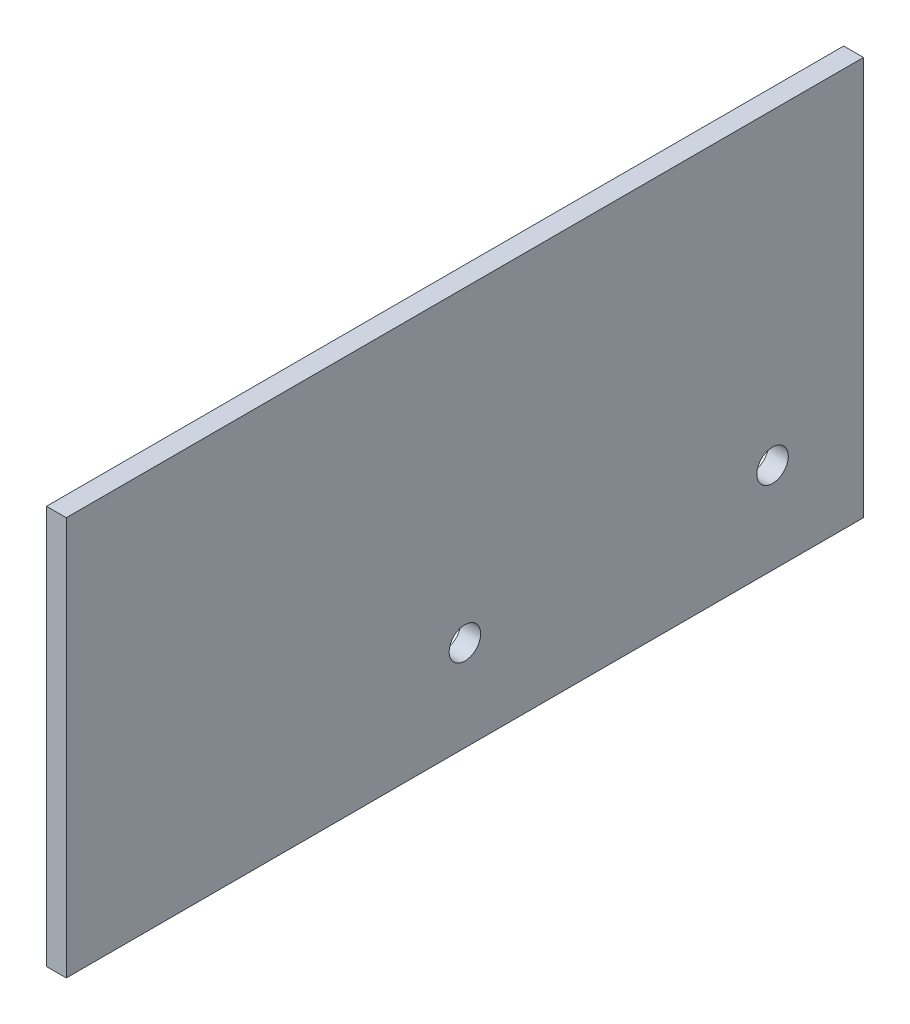
ISO-10303-21;
HEADER;
FILE_DESCRIPTION(('STEP AP214'),'2;1');
FILE_NAME('part.step','',(''),(''),'','','');
FILE_SCHEMA(('AUTOMOTIVE_DESIGN { 1 0 10303 214 1 1 1 1 }'));
ENDSEC;
DATA;
#1=APPLICATION_CONTEXT('core data for automotive mechanical design processes');
#2=APPLICATION_PROTOCOL_DEFINITION('international standard','automotive_design',2000,#1);
#3=PRODUCT_CONTEXT('',#1,'mechanical');
#4=PRODUCT('Part','Part','',(#3));
#5=PRODUCT_RELATED_PRODUCT_CATEGORY('part','',(#4));
#6=PRODUCT_DEFINITION_FORMATION('','',#4);
#7=PRODUCT_DEFINITION_CONTEXT('part definition',#1,'design');
#8=PRODUCT_DEFINITION('design','',#6,#7);
#9=PRODUCT_DEFINITION_SHAPE('','',#8);
#10=(LENGTH_UNIT() NAMED_UNIT(*) SI_UNIT(.MILLI.,.METRE.));
#11=(NAMED_UNIT(*) PLANE_ANGLE_UNIT() SI_UNIT($,.RADIAN.));
#12=(NAMED_UNIT(*) SI_UNIT($,.STERADIAN.) SOLID_ANGLE_UNIT());
#13=UNCERTAINTY_MEASURE_WITH_UNIT(LENGTH_MEASURE(1.E-05),#10,'distance_accuracy_value','');
#14=(GEOMETRIC_REPRESENTATION_CONTEXT(3) GLOBAL_UNCERTAINTY_ASSIGNED_CONTEXT((#13)) GLOBAL_UNIT_ASSIGNED_CONTEXT((#10,
#11,#12)) REPRESENTATION_CONTEXT('',''));
#15=CARTESIAN_POINT('',(0.,0.,0.));
#16=DIRECTION('',(0.,0.,1.));
#17=DIRECTION('',(1.,0.,0.));
#18=AXIS2_PLACEMENT_3D('',#15,#16,#17);
#19=CARTESIAN_POINT('',(2.25,0.,0.));
#20=DIRECTION('',(1.,0.,0.));
#21=DIRECTION('',(0.,0.,-1.));
#22=AXIS2_PLACEMENT_3D('',#19,#20,#21);
#23=PLANE('',#22);
#24=CARTESIAN_POINT('',(2.25,-69.85,0.));
#25=DIRECTION('',(1.,0.,0.));
#26=DIRECTION('',(0.,0.,-1.));
#27=AXIS2_PLACEMENT_3D('',#24,#25,#26);
#28=CIRCLE('',#27,3.56870000000001);
#29=CARTESIAN_POINT('',(2.25,-69.85,-3.56870000000001));
#30=VERTEX_POINT('',#29);
#31=EDGE_CURVE('E108',#30,#30,#28,.T.);
#32=ORIENTED_EDGE('',*,*,#31,.F.);
#33=EDGE_LOOP('',(#32));
#34=FACE_BOUND('',#33,.T.);
#35=DIRECTION('',(0.,0.,1.));
#36=VECTOR('',#35,1.);
#37=CARTESIAN_POINT('',(2.25,0.,-90.5));
#38=LINE('',#37,#36);
#39=CARTESIAN_POINT('',(2.25,0.,-90.5));
#40=VERTEX_POINT('',#39);
#41=CARTESIAN_POINT('',(2.25,0.,90.5));
#42=VERTEX_POINT('',#41);
#43=EDGE_CURVE('E86',#40,#42,#38,.T.);
#44=ORIENTED_EDGE('',*,*,#43,.T.);
#45=DIRECTION('',(0.,-1.,0.));
#46=VECTOR('',#45,1.);
#47=CARTESIAN_POINT('',(2.25,0.,90.5));
#48=LINE('',#47,#46);
#49=CARTESIAN_POINT('',(2.25,-90.5,90.5));
#50=VERTEX_POINT('',#49);
#51=EDGE_CURVE('E81',#42,#50,#48,.T.);
#52=ORIENTED_EDGE('',*,*,#51,.T.);
#53=DIRECTION('',(0.,0.,-1.));
#54=VECTOR('',#53,1.);
#55=CARTESIAN_POINT('',(2.25,-90.5,90.5));
#56=LINE('',#55,#54);
#57=CARTESIAN_POINT('',(2.25,-90.5,-90.5));
#58=VERTEX_POINT('',#57);
#59=EDGE_CURVE('E84',#50,#58,#56,.T.);
#60=ORIENTED_EDGE('',*,*,#59,.T.);
#61=DIRECTION('',(0.,1.,0.));
#62=VECTOR('',#61,1.);
#63=CARTESIAN_POINT('',(2.25,-90.5,-90.5));
#64=LINE('',#63,#62);
#65=EDGE_CURVE('E51',#58,#40,#64,.T.);
#66=ORIENTED_EDGE('',*,*,#65,.T.);
#67=EDGE_LOOP('',(#44,#52,#60,#66));
#68=FACE_BOUND('',#67,.T.);
#69=CARTESIAN_POINT('',(2.25,-69.85,-69.85));
#70=DIRECTION('',(1.,0.,0.));
#71=DIRECTION('',(0.,0.,-1.));
#72=AXIS2_PLACEMENT_3D('',#69,#70,#71);
#73=CIRCLE('',#72,3.56870000000001);
#74=CARTESIAN_POINT('',(2.25,-69.85,-73.4187));
#75=VERTEX_POINT('',#74);
#76=EDGE_CURVE('E116',#75,#75,#73,.T.);
#77=ORIENTED_EDGE('',*,*,#76,.F.);
#78=EDGE_LOOP('',(#77));
#79=FACE_BOUND('',#78,.T.);
#80=ADVANCED_FACE('F32',(#34,#68,#79),#23,.T.);
#81=CARTESIAN_POINT('',(-2.25,0.,0.));
#82=DIRECTION('',(1.,0.,0.));
#83=DIRECTION('',(0.,0.,-1.));
#84=AXIS2_PLACEMENT_3D('',#81,#82,#83);
#85=PLANE('',#84);
#86=CARTESIAN_POINT('',(-2.25,-69.85,0.));
#87=DIRECTION('',(1.,0.,0.));
#88=DIRECTION('',(0.,0.,-1.));
#89=AXIS2_PLACEMENT_3D('',#86,#87,#88);
#90=CIRCLE('',#89,3.56870000000001);
#91=CARTESIAN_POINT('',(-2.25,-69.85,-3.56870000000001));
#92=VERTEX_POINT('',#91);
#93=EDGE_CURVE('E102',#92,#92,#90,.F.);
#94=ORIENTED_EDGE('',*,*,#93,.F.);
#95=EDGE_LOOP('',(#94));
#96=FACE_BOUND('',#95,.T.);
#97=DIRECTION('',(0.,0.,1.));
#98=VECTOR('',#97,1.);
#99=CARTESIAN_POINT('',(-2.25,0.,-90.5));
#100=LINE('',#99,#98);
#101=CARTESIAN_POINT('',(-2.25,0.,-90.5));
#102=VERTEX_POINT('',#101);
#103=CARTESIAN_POINT('',(-2.25,0.,90.5));
#104=VERTEX_POINT('',#103);
#105=EDGE_CURVE('E99',#102,#104,#100,.T.);
#106=ORIENTED_EDGE('',*,*,#105,.F.);
#107=DIRECTION('',(0.,1.,0.));
#108=VECTOR('',#107,1.);
#109=CARTESIAN_POINT('',(-2.25,-90.5,-90.5));
#110=LINE('',#109,#108);
#111=CARTESIAN_POINT('',(-2.25,-90.5,-90.5));
#112=VERTEX_POINT('',#111);
#113=EDGE_CURVE('E74',#112,#102,#110,.T.);
#114=ORIENTED_EDGE('',*,*,#113,.F.);
#115=DIRECTION('',(0.,0.,-1.));
#116=VECTOR('',#115,1.);
#117=CARTESIAN_POINT('',(-2.25,-90.5,90.5));
#118=LINE('',#117,#116);
#119=CARTESIAN_POINT('',(-2.25,-90.5,90.5));
#120=VERTEX_POINT('',#119);
#121=EDGE_CURVE('E68',#120,#112,#118,.T.);
#122=ORIENTED_EDGE('',*,*,#121,.F.);
#123=DIRECTION('',(0.,-1.,0.));
#124=VECTOR('',#123,1.);
#125=CARTESIAN_POINT('',(-2.25,0.,90.5));
#126=LINE('',#125,#124);
#127=EDGE_CURVE('E90',#104,#120,#126,.T.);
#128=ORIENTED_EDGE('',*,*,#127,.F.);
#129=EDGE_LOOP('',(#106,#114,#122,#128));
#130=FACE_BOUND('',#129,.T.);
#131=CARTESIAN_POINT('',(-2.25,-69.85,-69.85));
#132=DIRECTION('',(1.,0.,0.));
#133=DIRECTION('',(0.,0.,-1.));
#134=AXIS2_PLACEMENT_3D('',#131,#132,#133);
#135=CIRCLE('',#134,3.56870000000001);
#136=CARTESIAN_POINT('',(-2.25,-69.85,-73.4187));
#137=VERTEX_POINT('',#136);
#138=EDGE_CURVE('E36',#137,#137,#135,.F.);
#139=ORIENTED_EDGE('',*,*,#138,.F.);
#140=EDGE_LOOP('',(#139));
#141=FACE_BOUND('',#140,.T.);
#142=ADVANCED_FACE('F124',(#96,#130,#141),#85,.F.);
#143=CARTESIAN_POINT('',(2.25,0.,-90.5));
#144=DIRECTION('',(0.,-1.,0.));
#145=DIRECTION('',(0.,0.,-1.));
#146=AXIS2_PLACEMENT_3D('',#143,#144,#145);
#147=PLANE('',#146);
#148=ORIENTED_EDGE('',*,*,#105,.T.);
#149=DIRECTION('',(-1.,0.,0.));
#150=VECTOR('',#149,1.);
#151=CARTESIAN_POINT('',(2.25,0.,90.5));
#152=LINE('',#151,#150);
#153=EDGE_CURVE('E11',#42,#104,#152,.T.);
#154=ORIENTED_EDGE('',*,*,#153,.F.);
#155=ORIENTED_EDGE('',*,*,#43,.F.);
#156=DIRECTION('',(-1.,0.,0.));
#157=VECTOR('',#156,1.);
#158=CARTESIAN_POINT('',(2.25,0.,-90.5));
#159=LINE('',#158,#157);
#160=EDGE_CURVE('E95',#40,#102,#159,.T.);
#161=ORIENTED_EDGE('',*,*,#160,.T.);
#162=EDGE_LOOP('',(#148,#154,#155,#161));
#163=FACE_BOUND('',#162,.T.);
#164=ADVANCED_FACE('F34',(#163),#147,.F.);
#165=CARTESIAN_POINT('',(2.25,0.,90.5));
#166=DIRECTION('',(0.,0.,-1.));
#167=DIRECTION('',(-1.,0.,0.));
#168=AXIS2_PLACEMENT_3D('',#165,#166,#167);
#169=PLANE('',#168);
#170=ORIENTED_EDGE('',*,*,#127,.T.);
#171=DIRECTION('',(-1.,0.,0.));
#172=VECTOR('',#171,1.);
#173=CARTESIAN_POINT('',(2.25,-90.5,90.5));
#174=LINE('',#173,#172);
#175=EDGE_CURVE('E42',#50,#120,#174,.T.);
#176=ORIENTED_EDGE('',*,*,#175,.F.);
#177=ORIENTED_EDGE('',*,*,#51,.F.);
#178=ORIENTED_EDGE('',*,*,#153,.T.);
#179=EDGE_LOOP('',(#170,#176,#177,#178));
#180=FACE_BOUND('',#179,.T.);
#181=ADVANCED_FACE('F89',(#180),#169,.F.);
#182=CARTESIAN_POINT('',(2.25,-90.5,90.5));
#183=DIRECTION('',(0.,1.,0.));
#184=DIRECTION('',(0.,0.,1.));
#185=AXIS2_PLACEMENT_3D('',#182,#183,#184);
#186=PLANE('',#185);
#187=ORIENTED_EDGE('',*,*,#121,.T.);
#188=DIRECTION('',(-1.,0.,0.));
#189=VECTOR('',#188,1.);
#190=CARTESIAN_POINT('',(2.25,-90.5,-90.5));
#191=LINE('',#190,#189);
#192=EDGE_CURVE('E91',#58,#112,#191,.T.);
#193=ORIENTED_EDGE('',*,*,#192,.F.);
#194=ORIENTED_EDGE('',*,*,#59,.F.);
#195=ORIENTED_EDGE('',*,*,#175,.T.);
#196=EDGE_LOOP('',(#187,#193,#194,#195));
#197=FACE_BOUND('',#196,.T.);
#198=ADVANCED_FACE('F93',(#197),#186,.F.);
#199=CARTESIAN_POINT('',(2.25,-90.5,-90.5));
#200=DIRECTION('',(0.,0.,1.));
#201=DIRECTION('',(1.,0.,0.));
#202=AXIS2_PLACEMENT_3D('',#199,#200,#201);
#203=PLANE('',#202);
#204=ORIENTED_EDGE('',*,*,#113,.T.);
#205=ORIENTED_EDGE('',*,*,#160,.F.);
#206=ORIENTED_EDGE('',*,*,#65,.F.);
#207=ORIENTED_EDGE('',*,*,#192,.T.);
#208=EDGE_LOOP('',(#204,#205,#206,#207));
#209=FACE_BOUND('',#208,.T.);
#210=ADVANCED_FACE('F137',(#209),#203,.F.);
#211=CARTESIAN_POINT('',(-2.25,-69.85,0.));
#212=DIRECTION('',(-1.,0.,0.));
#213=DIRECTION('',(0.,0.,1.));
#214=AXIS2_PLACEMENT_3D('',#211,#212,#213);
#215=CYLINDRICAL_SURFACE('',#214,3.56870000000001);
#216=ORIENTED_EDGE('',*,*,#31,.T.);
#217=EDGE_LOOP('',(#216));
#218=FACE_BOUND('',#217,.T.);
#219=ORIENTED_EDGE('',*,*,#93,.T.);
#220=EDGE_LOOP('',(#219));
#221=FACE_BOUND('',#220,.T.);
#222=ADVANCED_FACE('F134',(#218,#221),#215,.F.);
#223=CARTESIAN_POINT('',(-2.25,-69.85,-69.85));
#224=DIRECTION('',(-1.,0.,0.));
#225=DIRECTION('',(0.,0.,1.));
#226=AXIS2_PLACEMENT_3D('',#223,#224,#225);
#227=CYLINDRICAL_SURFACE('',#226,3.56870000000001);
#228=ORIENTED_EDGE('',*,*,#76,.T.);
#229=EDGE_LOOP('',(#228));
#230=FACE_BOUND('',#229,.T.);
#231=ORIENTED_EDGE('',*,*,#138,.T.);
#232=EDGE_LOOP('',(#231));
#233=FACE_BOUND('',#232,.T.);
#234=ADVANCED_FACE('F121',(#230,#233),#227,.F.);
#235=CLOSED_SHELL('',(#80,#142,#164,#181,#198,#210,#222,#234));
#236=MANIFOLD_SOLID_BREP('B2',#235);
#237=ADVANCED_BREP_SHAPE_REPRESENTATION('',(#18,#236),#14);
#238=SHAPE_DEFINITION_REPRESENTATION(#9,#237);
ENDSEC;
END-ISO-10303-21;
